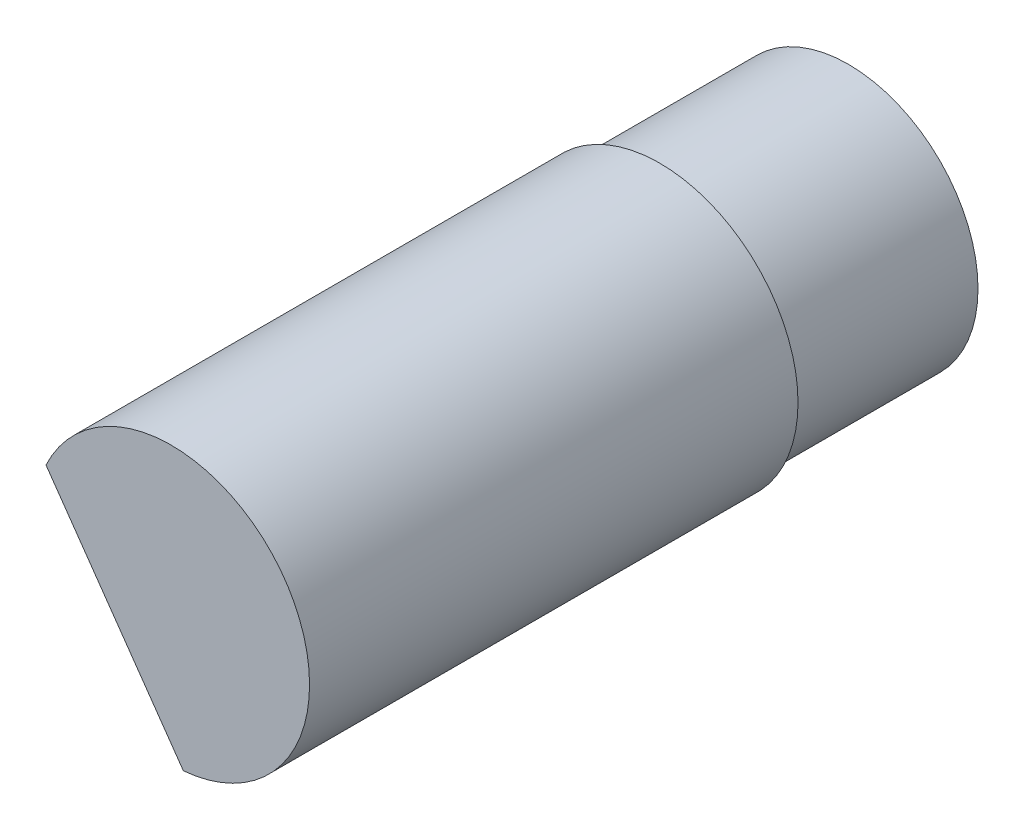
ISO-10303-21;
HEADER;
FILE_DESCRIPTION(('STEP AP214'),'2;1');
FILE_NAME('part.step','',(''),(''),'','','');
FILE_SCHEMA(('AUTOMOTIVE_DESIGN { 1 0 10303 214 1 1 1 1 }'));
ENDSEC;
DATA;
#1=APPLICATION_CONTEXT('core data for automotive mechanical design processes');
#2=APPLICATION_PROTOCOL_DEFINITION('international standard','automotive_design',2000,#1);
#3=PRODUCT_CONTEXT('',#1,'mechanical');
#4=PRODUCT('Part','Part','',(#3));
#5=PRODUCT_RELATED_PRODUCT_CATEGORY('part','',(#4));
#6=PRODUCT_DEFINITION_FORMATION('','',#4);
#7=PRODUCT_DEFINITION_CONTEXT('part definition',#1,'design');
#8=PRODUCT_DEFINITION('design','',#6,#7);
#9=PRODUCT_DEFINITION_SHAPE('','',#8);
#10=(LENGTH_UNIT() NAMED_UNIT(*) SI_UNIT(.MILLI.,.METRE.));
#11=(NAMED_UNIT(*) PLANE_ANGLE_UNIT() SI_UNIT($,.RADIAN.));
#12=(NAMED_UNIT(*) SI_UNIT($,.STERADIAN.) SOLID_ANGLE_UNIT());
#13=UNCERTAINTY_MEASURE_WITH_UNIT(LENGTH_MEASURE(1.E-05),#10,'distance_accuracy_value','');
#14=(GEOMETRIC_REPRESENTATION_CONTEXT(3) GLOBAL_UNCERTAINTY_ASSIGNED_CONTEXT((#13)) GLOBAL_UNIT_ASSIGNED_CONTEXT((#10,
#11,#12)) REPRESENTATION_CONTEXT('',''));
#15=CARTESIAN_POINT('',(0.,0.,0.));
#16=DIRECTION('',(0.,0.,1.));
#17=DIRECTION('',(1.,0.,0.));
#18=AXIS2_PLACEMENT_3D('',#15,#16,#17);
#19=CARTESIAN_POINT('',(110.576144023364,32.6969351903399,27.6013333333333));
#20=DIRECTION('',(0.,0.,1.));
#21=DIRECTION('',(1.,0.,0.));
#22=AXIS2_PLACEMENT_3D('',#19,#20,#21);
#23=PLANE('',#22);
#24=CARTESIAN_POINT('',(110.576144023364,32.6969351903399,27.6013333333333));
#25=DIRECTION('',(0.,0.,1.));
#26=DIRECTION('',(1.,0.,0.));
#27=AXIS2_PLACEMENT_3D('',#24,#25,#26);
#28=CIRCLE('',#27,6.32666666666666);
#29=CARTESIAN_POINT('',(104.842236757379,35.3707000596194,27.6013333333333));
#30=VERTEX_POINT('',#29);
#31=CARTESIAN_POINT('',(111.127549355815,26.3943434004128,27.6013333333333));
#32=VERTEX_POINT('',#31);
#33=EDGE_CURVE('E66',#30,#32,#28,.T.);
#34=ORIENTED_EDGE('',*,*,#33,.T.);
#35=DIRECTION('',(-0.573576436351043,0.819152044288994,0.));
#36=VECTOR('',#35,1.);
#37=CARTESIAN_POINT('',(86.9689897188893,60.8963421916485,27.6013333333333));
#38=LINE('',#37,#36);
#39=EDGE_CURVE('E69',#32,#30,#38,.T.);
#40=ORIENTED_EDGE('',*,*,#39,.T.);
#41=EDGE_LOOP('',(#34,#40));
#42=FACE_BOUND('',#41,.T.);
#43=ADVANCED_FACE('F32',(#42),#23,.T.);
#44=CARTESIAN_POINT('',(110.576144023364,32.6969351903399,8.636));
#45=DIRECTION('',(0.,0.,-1.));
#46=DIRECTION('',(-1.,0.,0.));
#47=AXIS2_PLACEMENT_3D('',#44,#45,#46);
#48=CYLINDRICAL_SURFACE('',#47,5.92666666666666);
#49=CARTESIAN_POINT('',(110.576144023364,32.6969351903399,8.636));
#50=DIRECTION('',(0.,0.,1.));
#51=DIRECTION('',(1.,0.,0.));
#52=AXIS2_PLACEMENT_3D('',#49,#50,#51);
#53=CIRCLE('',#52,5.92666666666666);
#54=CARTESIAN_POINT('',(116.502810690031,32.6969351903399,8.636));
#55=VERTEX_POINT('',#54);
#56=EDGE_CURVE('E11',#55,#55,#53,.T.);
#57=ORIENTED_EDGE('',*,*,#56,.F.);
#58=EDGE_LOOP('',(#57));
#59=FACE_BOUND('',#58,.T.);
#60=CARTESIAN_POINT('',(110.576144023364,32.6969351903399,0.));
#61=DIRECTION('',(0.,0.,1.));
#62=DIRECTION('',(1.,0.,0.));
#63=AXIS2_PLACEMENT_3D('',#60,#61,#62);
#64=CIRCLE('',#63,5.92666666666666);
#65=CARTESIAN_POINT('',(116.502810690031,32.6969351903399,0.));
#66=VERTEX_POINT('',#65);
#67=EDGE_CURVE('E36',#66,#66,#64,.T.);
#68=ORIENTED_EDGE('',*,*,#67,.T.);
#69=EDGE_LOOP('',(#68));
#70=FACE_BOUND('',#69,.T.);
#71=ADVANCED_FACE('F34',(#59,#70),#48,.T.);
#72=CARTESIAN_POINT('',(110.576144023364,32.6969351903399,0.));
#73=DIRECTION('',(0.,0.,1.));
#74=DIRECTION('',(1.,0.,0.));
#75=AXIS2_PLACEMENT_3D('',#72,#73,#74);
#76=PLANE('',#75);
#77=ORIENTED_EDGE('',*,*,#67,.F.);
#78=EDGE_LOOP('',(#77));
#79=FACE_BOUND('',#78,.T.);
#80=ADVANCED_FACE('F94',(#79),#76,.F.);
#81=CARTESIAN_POINT('',(110.576144023364,32.6969351903399,27.6013333333333));
#82=DIRECTION('',(0.,0.,-1.));
#83=DIRECTION('',(-1.,0.,0.));
#84=AXIS2_PLACEMENT_3D('',#81,#82,#83);
#85=CYLINDRICAL_SURFACE('',#84,6.32666666666666);
#86=ORIENTED_EDGE('',*,*,#33,.F.);
#87=DIRECTION('',(0.,0.,-1.));
#88=VECTOR('',#87,1.);
#89=CARTESIAN_POINT('',(104.842236757379,35.3707000596194,30.988));
#90=LINE('',#89,#88);
#91=CARTESIAN_POINT('',(104.842236757379,35.3707000596194,30.988));
#92=VERTEX_POINT('',#91);
#93=EDGE_CURVE('E47',#92,#30,#90,.T.);
#94=ORIENTED_EDGE('',*,*,#93,.F.);
#95=CARTESIAN_POINT('',(110.576144023364,32.6969351903399,30.988));
#96=DIRECTION('',(0.,0.,1.));
#97=DIRECTION('',(1.,0.,0.));
#98=AXIS2_PLACEMENT_3D('',#95,#96,#97);
#99=CIRCLE('',#98,6.32666666666666);
#100=CARTESIAN_POINT('',(111.127549355815,26.3943434004128,30.988));
#101=VERTEX_POINT('',#100);
#102=EDGE_CURVE('E55',#101,#92,#99,.T.);
#103=ORIENTED_EDGE('',*,*,#102,.F.);
#104=DIRECTION('',(0.,0.,-1.));
#105=VECTOR('',#104,1.);
#106=CARTESIAN_POINT('',(111.127549355815,26.3943434004128,30.988));
#107=LINE('',#106,#105);
#108=EDGE_CURVE('E62',#101,#32,#107,.T.);
#109=ORIENTED_EDGE('',*,*,#108,.T.);
#110=EDGE_LOOP('',(#86,#94,#103,#109));
#111=FACE_BOUND('',#110,.T.);
#112=CARTESIAN_POINT('',(110.576144023364,32.6969351903399,8.636));
#113=DIRECTION('',(0.,0.,1.));
#114=DIRECTION('',(1.,0.,0.));
#115=AXIS2_PLACEMENT_3D('',#112,#113,#114);
#116=CIRCLE('',#115,6.32666666666666);
#117=CARTESIAN_POINT('',(116.902810690031,32.6969351903399,8.636));
#118=VERTEX_POINT('',#117);
#119=EDGE_CURVE('E67',#118,#118,#116,.T.);
#120=ORIENTED_EDGE('',*,*,#119,.T.);
#121=EDGE_LOOP('',(#120));
#122=FACE_BOUND('',#121,.T.);
#123=ADVANCED_FACE('F63',(#111,#122),#85,.T.);
#124=CARTESIAN_POINT('',(110.576144023364,32.6969351903399,8.636));
#125=DIRECTION('',(0.,0.,1.));
#126=DIRECTION('',(1.,0.,0.));
#127=AXIS2_PLACEMENT_3D('',#124,#125,#126);
#128=PLANE('',#127);
#129=ORIENTED_EDGE('',*,*,#56,.T.);
#130=EDGE_LOOP('',(#129));
#131=FACE_BOUND('',#130,.T.);
#132=ORIENTED_EDGE('',*,*,#119,.F.);
#133=EDGE_LOOP('',(#132));
#134=FACE_BOUND('',#133,.T.);
#135=ADVANCED_FACE('F87',(#131,#134),#128,.F.);
#136=CARTESIAN_POINT('',(86.9689897188893,60.8963421916485,30.988));
#137=DIRECTION('',(-0.819152044288994,-0.573576436351043,0.));
#138=DIRECTION('',(0.573576436351043,-0.819152044288994,0.));
#139=AXIS2_PLACEMENT_3D('',#136,#137,#138);
#140=PLANE('',#139);
#141=ORIENTED_EDGE('',*,*,#39,.F.);
#142=ORIENTED_EDGE('',*,*,#108,.F.);
#143=DIRECTION('',(-0.573576436351043,0.819152044288994,0.));
#144=VECTOR('',#143,1.);
#145=CARTESIAN_POINT('',(86.9689897188893,60.8963421916485,30.988));
#146=LINE('',#145,#144);
#147=EDGE_CURVE('E72',#101,#92,#146,.T.);
#148=ORIENTED_EDGE('',*,*,#147,.T.);
#149=ORIENTED_EDGE('',*,*,#93,.T.);
#150=EDGE_LOOP('',(#141,#142,#148,#149));
#151=FACE_BOUND('',#150,.T.);
#152=ADVANCED_FACE('F70',(#151),#140,.T.);
#153=CARTESIAN_POINT('',(0.,0.,30.988));
#154=DIRECTION('',(0.,0.,1.));
#155=DIRECTION('',(1.,0.,0.));
#156=AXIS2_PLACEMENT_3D('',#153,#154,#155);
#157=PLANE('',#156);
#158=ORIENTED_EDGE('',*,*,#147,.F.);
#159=ORIENTED_EDGE('',*,*,#102,.T.);
#160=EDGE_LOOP('',(#158,#159));
#161=FACE_BOUND('',#160,.T.);
#162=ADVANCED_FACE('F81',(#161),#157,.T.);
#163=CLOSED_SHELL('',(#43,#71,#80,#123,#135,#152,#162));
#164=MANIFOLD_SOLID_BREP('B2',#163);
#165=ADVANCED_BREP_SHAPE_REPRESENTATION('',(#18,#164),#14);
#166=SHAPE_DEFINITION_REPRESENTATION(#9,#165);
ENDSEC;
END-ISO-10303-21;
